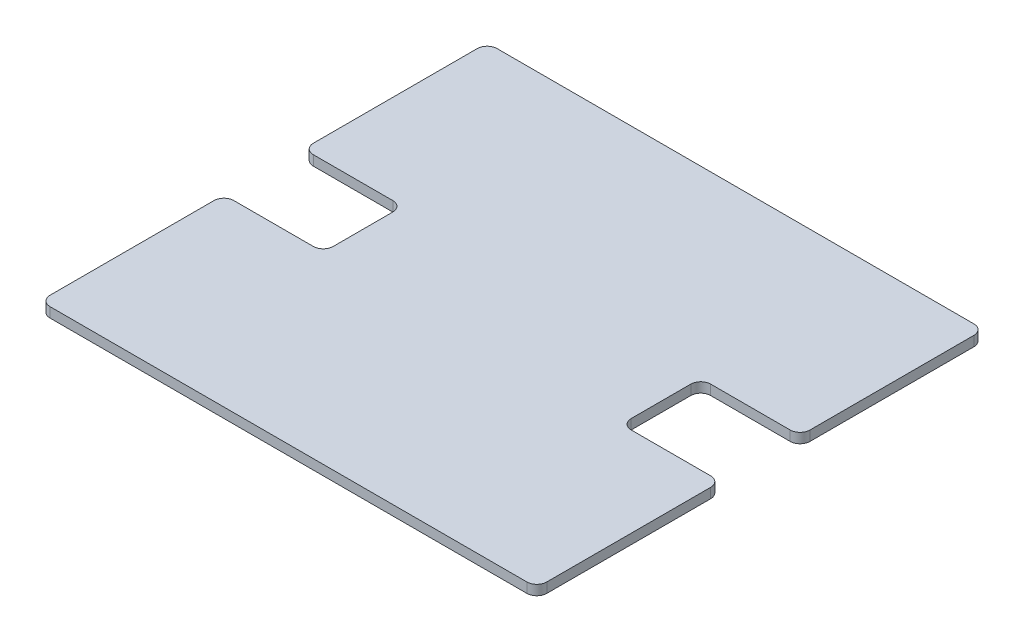
ISO-10303-21;
HEADER;
FILE_DESCRIPTION(('STEP AP214'),'2;1');
FILE_NAME('part.step','',(''),(''),'','','');
FILE_SCHEMA(('AUTOMOTIVE_DESIGN { 1 0 10303 214 1 1 1 1 }'));
ENDSEC;
DATA;
#1=APPLICATION_CONTEXT('core data for automotive mechanical design processes');
#2=APPLICATION_PROTOCOL_DEFINITION('international standard','automotive_design',2000,#1);
#3=PRODUCT_CONTEXT('',#1,'mechanical');
#4=PRODUCT('Part','Part','',(#3));
#5=PRODUCT_RELATED_PRODUCT_CATEGORY('part','',(#4));
#6=PRODUCT_DEFINITION_FORMATION('','',#4);
#7=PRODUCT_DEFINITION_CONTEXT('part definition',#1,'design');
#8=PRODUCT_DEFINITION('design','',#6,#7);
#9=PRODUCT_DEFINITION_SHAPE('','',#8);
#10=(LENGTH_UNIT() NAMED_UNIT(*) SI_UNIT(.MILLI.,.METRE.));
#11=(NAMED_UNIT(*) PLANE_ANGLE_UNIT() SI_UNIT($,.RADIAN.));
#12=(NAMED_UNIT(*) SI_UNIT($,.STERADIAN.) SOLID_ANGLE_UNIT());
#13=UNCERTAINTY_MEASURE_WITH_UNIT(LENGTH_MEASURE(1.E-05),#10,'distance_accuracy_value','');
#14=(GEOMETRIC_REPRESENTATION_CONTEXT(3) GLOBAL_UNCERTAINTY_ASSIGNED_CONTEXT((#13)) GLOBAL_UNIT_ASSIGNED_CONTEXT((#10,
#11,#12)) REPRESENTATION_CONTEXT('',''));
#15=CARTESIAN_POINT('',(0.,0.,0.));
#16=DIRECTION('',(0.,0.,1.));
#17=DIRECTION('',(1.,0.,0.));
#18=AXIS2_PLACEMENT_3D('',#15,#16,#17);
#19=CARTESIAN_POINT('',(-50.,2.,-45.));
#20=DIRECTION('',(1.,0.,0.));
#21=DIRECTION('',(0.,0.,-1.));
#22=AXIS2_PLACEMENT_3D('',#19,#20,#21);
#23=PLANE('',#22);
#24=DIRECTION('',(0.,0.,1.));
#25=VECTOR('',#24,1.);
#26=CARTESIAN_POINT('',(-50.,2.,-45.));
#27=LINE('',#26,#25);
#28=CARTESIAN_POINT('',(-50.,2.,-43.));
#29=VERTEX_POINT('',#28);
#30=CARTESIAN_POINT('',(-50.,2.,-10.));
#31=VERTEX_POINT('',#30);
#32=EDGE_CURVE('E234',#29,#31,#27,.T.);
#33=ORIENTED_EDGE('',*,*,#32,.F.);
#34=DIRECTION('',(0.,-1.,0.));
#35=VECTOR('',#34,1.);
#36=CARTESIAN_POINT('',(-50.,2.,-43.));
#37=LINE('',#36,#35);
#38=CARTESIAN_POINT('',(-50.,0.,-43.));
#39=VERTEX_POINT('',#38);
#40=EDGE_CURVE('E339',#29,#39,#37,.T.);
#41=ORIENTED_EDGE('',*,*,#40,.T.);
#42=DIRECTION('',(0.,0.,1.));
#43=VECTOR('',#42,1.);
#44=CARTESIAN_POINT('',(-50.,0.,-45.));
#45=LINE('',#44,#43);
#46=CARTESIAN_POINT('',(-50.,0.,-10.));
#47=VERTEX_POINT('',#46);
#48=EDGE_CURVE('E396',#39,#47,#45,.T.);
#49=ORIENTED_EDGE('',*,*,#48,.T.);
#50=DIRECTION('',(0.,-1.,0.));
#51=VECTOR('',#50,1.);
#52=CARTESIAN_POINT('',(-50.,2.,-10.));
#53=LINE('',#52,#51);
#54=EDGE_CURVE('E336',#47,#31,#53,.F.);
#55=ORIENTED_EDGE('',*,*,#54,.T.);
#56=EDGE_LOOP('',(#33,#41,#49,#55));
#57=FACE_BOUND('',#56,.T.);
#58=ADVANCED_FACE('F41',(#57),#23,.F.);
#59=CARTESIAN_POINT('',(-50.,2.,-8.00000000000001));
#60=DIRECTION('',(0.,0.,-1.));
#61=DIRECTION('',(-1.,0.,0.));
#62=AXIS2_PLACEMENT_3D('',#59,#60,#61);
#63=PLANE('',#62);
#64=DIRECTION('',(1.,0.,0.));
#65=VECTOR('',#64,1.);
#66=CARTESIAN_POINT('',(-50.,2.,-8.00000000000001));
#67=LINE('',#66,#65);
#68=CARTESIAN_POINT('',(-48.,2.,-8.00000000000001));
#69=VERTEX_POINT('',#68);
#70=CARTESIAN_POINT('',(-32.,2.,-8.00000000000001));
#71=VERTEX_POINT('',#70);
#72=EDGE_CURVE('E240',#69,#71,#67,.T.);
#73=ORIENTED_EDGE('',*,*,#72,.F.);
#74=DIRECTION('',(0.,-1.,0.));
#75=VECTOR('',#74,1.);
#76=CARTESIAN_POINT('',(-48.,2.,-8.00000000000001));
#77=LINE('',#76,#75);
#78=CARTESIAN_POINT('',(-48.,0.,-8.00000000000001));
#79=VERTEX_POINT('',#78);
#80=EDGE_CURVE('E360',#69,#79,#77,.T.);
#81=ORIENTED_EDGE('',*,*,#80,.T.);
#82=DIRECTION('',(1.,0.,0.));
#83=VECTOR('',#82,1.);
#84=CARTESIAN_POINT('',(-50.,0.,-8.00000000000001));
#85=LINE('',#84,#83);
#86=CARTESIAN_POINT('',(-32.,0.,-8.00000000000001));
#87=VERTEX_POINT('',#86);
#88=EDGE_CURVE('E384',#79,#87,#85,.T.);
#89=ORIENTED_EDGE('',*,*,#88,.T.);
#90=DIRECTION('',(0.,-1.,0.));
#91=VECTOR('',#90,1.);
#92=CARTESIAN_POINT('',(-32.,2.,-8.00000000000001));
#93=LINE('',#92,#91);
#94=EDGE_CURVE('E357',#87,#71,#93,.F.);
#95=ORIENTED_EDGE('',*,*,#94,.T.);
#96=EDGE_LOOP('',(#73,#81,#89,#95));
#97=FACE_BOUND('',#96,.T.);
#98=ADVANCED_FACE('F392',(#97),#63,.F.);
#99=CARTESIAN_POINT('',(-30.,2.,-8.00000000000001));
#100=DIRECTION('',(1.,0.,0.));
#101=DIRECTION('',(0.,0.,-1.));
#102=AXIS2_PLACEMENT_3D('',#99,#100,#101);
#103=PLANE('',#102);
#104=DIRECTION('',(0.,0.,1.));
#105=VECTOR('',#104,1.);
#106=CARTESIAN_POINT('',(-30.,0.,-8.00000000000001));
#107=LINE('',#106,#105);
#108=CARTESIAN_POINT('',(-30.,0.,-6.00000000000001));
#109=VERTEX_POINT('',#108);
#110=CARTESIAN_POINT('',(-30.,0.,6.00000000000001));
#111=VERTEX_POINT('',#110);
#112=EDGE_CURVE('E386',#109,#111,#107,.T.);
#113=ORIENTED_EDGE('',*,*,#112,.T.);
#114=DIRECTION('',(0.,-1.,0.));
#115=VECTOR('',#114,1.);
#116=CARTESIAN_POINT('',(-30.,2.,6.00000000000001));
#117=LINE('',#116,#115);
#118=CARTESIAN_POINT('',(-30.,2.,6.00000000000001));
#119=VERTEX_POINT('',#118);
#120=EDGE_CURVE('E354',#111,#119,#117,.F.);
#121=ORIENTED_EDGE('',*,*,#120,.T.);
#122=DIRECTION('',(0.,0.,1.));
#123=VECTOR('',#122,1.);
#124=CARTESIAN_POINT('',(-30.,2.,-8.00000000000001));
#125=LINE('',#124,#123);
#126=CARTESIAN_POINT('',(-30.,2.,-6.00000000000001));
#127=VERTEX_POINT('',#126);
#128=EDGE_CURVE('E403',#127,#119,#125,.T.);
#129=ORIENTED_EDGE('',*,*,#128,.F.);
#130=DIRECTION('',(0.,-1.,0.));
#131=VECTOR('',#130,1.);
#132=CARTESIAN_POINT('',(-30.,0.,-6.00000000000001));
#133=LINE('',#132,#131);
#134=EDGE_CURVE('E350',#127,#109,#133,.T.);
#135=ORIENTED_EDGE('',*,*,#134,.T.);
#136=EDGE_LOOP('',(#113,#121,#129,#135));
#137=FACE_BOUND('',#136,.T.);
#138=ADVANCED_FACE('F406',(#137),#103,.F.);
#139=CARTESIAN_POINT('',(-50.,2.,8.00000000000001));
#140=DIRECTION('',(0.,0.,1.));
#141=DIRECTION('',(1.,0.,0.));
#142=AXIS2_PLACEMENT_3D('',#139,#140,#141);
#143=PLANE('',#142);
#144=DIRECTION('',(-1.,0.,0.));
#145=VECTOR('',#144,1.);
#146=CARTESIAN_POINT('',(-50.,0.,8.00000000000001));
#147=LINE('',#146,#145);
#148=CARTESIAN_POINT('',(-32.,0.,8.00000000000001));
#149=VERTEX_POINT('',#148);
#150=CARTESIAN_POINT('',(-48.,0.,8.00000000000001));
#151=VERTEX_POINT('',#150);
#152=EDGE_CURVE('E449',#149,#151,#147,.T.);
#153=ORIENTED_EDGE('',*,*,#152,.T.);
#154=DIRECTION('',(0.,-1.,0.));
#155=VECTOR('',#154,1.);
#156=CARTESIAN_POINT('',(-48.,2.,8.00000000000001));
#157=LINE('',#156,#155);
#158=CARTESIAN_POINT('',(-48.,2.,8.00000000000001));
#159=VERTEX_POINT('',#158);
#160=EDGE_CURVE('E347',#151,#159,#157,.F.);
#161=ORIENTED_EDGE('',*,*,#160,.T.);
#162=DIRECTION('',(-1.,0.,0.));
#163=VECTOR('',#162,1.);
#164=CARTESIAN_POINT('',(-50.,2.,8.00000000000001));
#165=LINE('',#164,#163);
#166=CARTESIAN_POINT('',(-32.,2.,8.00000000000001));
#167=VERTEX_POINT('',#166);
#168=EDGE_CURVE('E409',#167,#159,#165,.T.);
#169=ORIENTED_EDGE('',*,*,#168,.F.);
#170=DIRECTION('',(0.,-1.,0.));
#171=VECTOR('',#170,1.);
#172=CARTESIAN_POINT('',(-32.,0.,8.00000000000001));
#173=LINE('',#172,#171);
#174=EDGE_CURVE('E343',#167,#149,#173,.T.);
#175=ORIENTED_EDGE('',*,*,#174,.T.);
#176=EDGE_LOOP('',(#153,#161,#169,#175));
#177=FACE_BOUND('',#176,.T.);
#178=ADVANCED_FACE('F694',(#177),#143,.F.);
#179=CARTESIAN_POINT('',(-50.,2.,45.));
#180=DIRECTION('',(1.,0.,0.));
#181=DIRECTION('',(0.,0.,-1.));
#182=AXIS2_PLACEMENT_3D('',#179,#180,#181);
#183=PLANE('',#182);
#184=DIRECTION('',(0.,0.,1.));
#185=VECTOR('',#184,1.);
#186=CARTESIAN_POINT('',(-50.,0.,45.));
#187=LINE('',#186,#185);
#188=CARTESIAN_POINT('',(-50.,0.,10.));
#189=VERTEX_POINT('',#188);
#190=CARTESIAN_POINT('',(-50.,0.,43.));
#191=VERTEX_POINT('',#190);
#192=EDGE_CURVE('E453',#189,#191,#187,.T.);
#193=ORIENTED_EDGE('',*,*,#192,.T.);
#194=DIRECTION('',(0.,-1.,0.));
#195=VECTOR('',#194,1.);
#196=CARTESIAN_POINT('',(-50.,2.,43.));
#197=LINE('',#196,#195);
#198=CARTESIAN_POINT('',(-50.,2.,43.));
#199=VERTEX_POINT('',#198);
#200=EDGE_CURVE('E333',#191,#199,#197,.F.);
#201=ORIENTED_EDGE('',*,*,#200,.T.);
#202=DIRECTION('',(0.,0.,1.));
#203=VECTOR('',#202,1.);
#204=CARTESIAN_POINT('',(-50.,2.,45.));
#205=LINE('',#204,#203);
#206=CARTESIAN_POINT('',(-50.,2.,10.));
#207=VERTEX_POINT('',#206);
#208=EDGE_CURVE('E414',#207,#199,#205,.T.);
#209=ORIENTED_EDGE('',*,*,#208,.F.);
#210=DIRECTION('',(0.,-1.,0.));
#211=VECTOR('',#210,1.);
#212=CARTESIAN_POINT('',(-50.,2.,10.));
#213=LINE('',#212,#211);
#214=EDGE_CURVE('E329',#207,#189,#213,.T.);
#215=ORIENTED_EDGE('',*,*,#214,.T.);
#216=EDGE_LOOP('',(#193,#201,#209,#215));
#217=FACE_BOUND('',#216,.T.);
#218=ADVANCED_FACE('F684',(#217),#183,.F.);
#219=CARTESIAN_POINT('',(-50.,2.,45.));
#220=DIRECTION('',(0.,0.,-1.));
#221=DIRECTION('',(-1.,0.,0.));
#222=AXIS2_PLACEMENT_3D('',#219,#220,#221);
#223=PLANE('',#222);
#224=DIRECTION('',(1.,0.,0.));
#225=VECTOR('',#224,1.);
#226=CARTESIAN_POINT('',(-50.,0.,45.));
#227=LINE('',#226,#225);
#228=CARTESIAN_POINT('',(-48.,0.,45.));
#229=VERTEX_POINT('',#228);
#230=CARTESIAN_POINT('',(48.,0.,45.));
#231=VERTEX_POINT('',#230);
#232=EDGE_CURVE('E457',#229,#231,#227,.T.);
#233=ORIENTED_EDGE('',*,*,#232,.T.);
#234=DIRECTION('',(0.,-1.,0.));
#235=VECTOR('',#234,1.);
#236=CARTESIAN_POINT('',(48.,2.,45.));
#237=LINE('',#236,#235);
#238=CARTESIAN_POINT('',(48.,2.,45.));
#239=VERTEX_POINT('',#238);
#240=EDGE_CURVE('E326',#231,#239,#237,.F.);
#241=ORIENTED_EDGE('',*,*,#240,.T.);
#242=DIRECTION('',(1.,0.,0.));
#243=VECTOR('',#242,1.);
#244=CARTESIAN_POINT('',(-50.,2.,45.));
#245=LINE('',#244,#243);
#246=CARTESIAN_POINT('',(-48.,2.,45.));
#247=VERTEX_POINT('',#246);
#248=EDGE_CURVE('E421',#247,#239,#245,.T.);
#249=ORIENTED_EDGE('',*,*,#248,.F.);
#250=DIRECTION('',(0.,-1.,0.));
#251=VECTOR('',#250,1.);
#252=CARTESIAN_POINT('',(-48.,2.,45.));
#253=LINE('',#252,#251);
#254=EDGE_CURVE('E322',#247,#229,#253,.T.);
#255=ORIENTED_EDGE('',*,*,#254,.T.);
#256=EDGE_LOOP('',(#233,#241,#249,#255));
#257=FACE_BOUND('',#256,.T.);
#258=ADVANCED_FACE('F674',(#257),#223,.F.);
#259=CARTESIAN_POINT('',(50.,2.,45.));
#260=DIRECTION('',(-1.,0.,0.));
#261=DIRECTION('',(0.,0.,1.));
#262=AXIS2_PLACEMENT_3D('',#259,#260,#261);
#263=PLANE('',#262);
#264=DIRECTION('',(0.,0.,-1.));
#265=VECTOR('',#264,1.);
#266=CARTESIAN_POINT('',(50.,0.,45.));
#267=LINE('',#266,#265);
#268=CARTESIAN_POINT('',(50.,0.,43.));
#269=VERTEX_POINT('',#268);
#270=CARTESIAN_POINT('',(50.,0.,10.));
#271=VERTEX_POINT('',#270);
#272=EDGE_CURVE('E461',#269,#271,#267,.T.);
#273=ORIENTED_EDGE('',*,*,#272,.T.);
#274=DIRECTION('',(0.,-1.,0.));
#275=VECTOR('',#274,1.);
#276=CARTESIAN_POINT('',(50.,2.,10.));
#277=LINE('',#276,#275);
#278=CARTESIAN_POINT('',(50.,2.,10.));
#279=VERTEX_POINT('',#278);
#280=EDGE_CURVE('E319',#271,#279,#277,.F.);
#281=ORIENTED_EDGE('',*,*,#280,.T.);
#282=DIRECTION('',(0.,0.,-1.));
#283=VECTOR('',#282,1.);
#284=CARTESIAN_POINT('',(50.,2.,45.));
#285=LINE('',#284,#283);
#286=CARTESIAN_POINT('',(50.,2.,43.));
#287=VERTEX_POINT('',#286);
#288=EDGE_CURVE('E425',#287,#279,#285,.T.);
#289=ORIENTED_EDGE('',*,*,#288,.F.);
#290=DIRECTION('',(0.,-1.,0.));
#291=VECTOR('',#290,1.);
#292=CARTESIAN_POINT('',(50.,2.,43.));
#293=LINE('',#292,#291);
#294=EDGE_CURVE('E315',#287,#269,#293,.T.);
#295=ORIENTED_EDGE('',*,*,#294,.T.);
#296=EDGE_LOOP('',(#273,#281,#289,#295));
#297=FACE_BOUND('',#296,.T.);
#298=ADVANCED_FACE('F664',(#297),#263,.F.);
#299=CARTESIAN_POINT('',(50.,2.,8.00000000000001));
#300=DIRECTION('',(0.,0.,1.));
#301=DIRECTION('',(1.,0.,0.));
#302=AXIS2_PLACEMENT_3D('',#299,#300,#301);
#303=PLANE('',#302);
#304=DIRECTION('',(-1.,0.,0.));
#305=VECTOR('',#304,1.);
#306=CARTESIAN_POINT('',(50.,0.,8.00000000000001));
#307=LINE('',#306,#305);
#308=CARTESIAN_POINT('',(48.,0.,8.00000000000001));
#309=VERTEX_POINT('',#308);
#310=CARTESIAN_POINT('',(32.,0.,8.00000000000001));
#311=VERTEX_POINT('',#310);
#312=EDGE_CURVE('E465',#309,#311,#307,.T.);
#313=ORIENTED_EDGE('',*,*,#312,.T.);
#314=DIRECTION('',(0.,-1.,0.));
#315=VECTOR('',#314,1.);
#316=CARTESIAN_POINT('',(32.,2.,8.00000000000001));
#317=LINE('',#316,#315);
#318=CARTESIAN_POINT('',(32.,2.,8.00000000000001));
#319=VERTEX_POINT('',#318);
#320=EDGE_CURVE('E312',#311,#319,#317,.F.);
#321=ORIENTED_EDGE('',*,*,#320,.T.);
#322=DIRECTION('',(-1.,0.,0.));
#323=VECTOR('',#322,1.);
#324=CARTESIAN_POINT('',(50.,2.,8.00000000000001));
#325=LINE('',#324,#323);
#326=CARTESIAN_POINT('',(48.,2.,8.00000000000001));
#327=VERTEX_POINT('',#326);
#328=EDGE_CURVE('E429',#327,#319,#325,.T.);
#329=ORIENTED_EDGE('',*,*,#328,.F.);
#330=DIRECTION('',(0.,-1.,0.));
#331=VECTOR('',#330,1.);
#332=CARTESIAN_POINT('',(48.,2.,8.00000000000001));
#333=LINE('',#332,#331);
#334=EDGE_CURVE('E308',#327,#309,#333,.T.);
#335=ORIENTED_EDGE('',*,*,#334,.T.);
#336=EDGE_LOOP('',(#313,#321,#329,#335));
#337=FACE_BOUND('',#336,.T.);
#338=ADVANCED_FACE('F654',(#337),#303,.F.);
#339=CARTESIAN_POINT('',(30.,2.,-8.00000000000001));
#340=DIRECTION('',(-1.,0.,0.));
#341=DIRECTION('',(0.,0.,1.));
#342=AXIS2_PLACEMENT_3D('',#339,#340,#341);
#343=PLANE('',#342);
#344=DIRECTION('',(0.,0.,-1.));
#345=VECTOR('',#344,1.);
#346=CARTESIAN_POINT('',(30.,0.,-8.00000000000001));
#347=LINE('',#346,#345);
#348=CARTESIAN_POINT('',(30.,0.,6.00000000000001));
#349=VERTEX_POINT('',#348);
#350=CARTESIAN_POINT('',(30.,0.,-6.00000000000001));
#351=VERTEX_POINT('',#350);
#352=EDGE_CURVE('E469',#349,#351,#347,.T.);
#353=ORIENTED_EDGE('',*,*,#352,.T.);
#354=DIRECTION('',(0.,-1.,0.));
#355=VECTOR('',#354,1.);
#356=CARTESIAN_POINT('',(30.,2.,-6.00000000000001));
#357=LINE('',#356,#355);
#358=CARTESIAN_POINT('',(30.,2.,-6.00000000000001));
#359=VERTEX_POINT('',#358);
#360=EDGE_CURVE('E305',#351,#359,#357,.F.);
#361=ORIENTED_EDGE('',*,*,#360,.T.);
#362=DIRECTION('',(0.,0.,-1.));
#363=VECTOR('',#362,1.);
#364=CARTESIAN_POINT('',(30.,2.,-8.00000000000001));
#365=LINE('',#364,#363);
#366=CARTESIAN_POINT('',(30.,2.,6.00000000000001));
#367=VERTEX_POINT('',#366);
#368=EDGE_CURVE('E433',#367,#359,#365,.T.);
#369=ORIENTED_EDGE('',*,*,#368,.F.);
#370=DIRECTION('',(0.,-1.,0.));
#371=VECTOR('',#370,1.);
#372=CARTESIAN_POINT('',(30.,0.,6.00000000000001));
#373=LINE('',#372,#371);
#374=EDGE_CURVE('E301',#367,#349,#373,.T.);
#375=ORIENTED_EDGE('',*,*,#374,.T.);
#376=EDGE_LOOP('',(#353,#361,#369,#375));
#377=FACE_BOUND('',#376,.T.);
#378=ADVANCED_FACE('F490',(#377),#343,.F.);
#379=CARTESIAN_POINT('',(50.,2.,-8.00000000000001));
#380=DIRECTION('',(0.,0.,-1.));
#381=DIRECTION('',(-1.,0.,0.));
#382=AXIS2_PLACEMENT_3D('',#379,#380,#381);
#383=PLANE('',#382);
#384=DIRECTION('',(1.,0.,0.));
#385=VECTOR('',#384,1.);
#386=CARTESIAN_POINT('',(50.,0.,-8.00000000000001));
#387=LINE('',#386,#385);
#388=CARTESIAN_POINT('',(32.,0.,-8.00000000000001));
#389=VERTEX_POINT('',#388);
#390=CARTESIAN_POINT('',(48.,0.,-8.00000000000001));
#391=VERTEX_POINT('',#390);
#392=EDGE_CURVE('E242',#389,#391,#387,.T.);
#393=ORIENTED_EDGE('',*,*,#392,.T.);
#394=DIRECTION('',(0.,-1.,0.));
#395=VECTOR('',#394,1.);
#396=CARTESIAN_POINT('',(48.,2.,-8.00000000000001));
#397=LINE('',#396,#395);
#398=CARTESIAN_POINT('',(48.,2.,-8.00000000000001));
#399=VERTEX_POINT('',#398);
#400=EDGE_CURVE('E57',#391,#399,#397,.F.);
#401=ORIENTED_EDGE('',*,*,#400,.T.);
#402=DIRECTION('',(1.,0.,0.));
#403=VECTOR('',#402,1.);
#404=CARTESIAN_POINT('',(50.,2.,-8.00000000000001));
#405=LINE('',#404,#403);
#406=CARTESIAN_POINT('',(32.,2.,-8.00000000000001));
#407=VERTEX_POINT('',#406);
#408=EDGE_CURVE('E436',#407,#399,#405,.T.);
#409=ORIENTED_EDGE('',*,*,#408,.F.);
#410=DIRECTION('',(0.,-1.,0.));
#411=VECTOR('',#410,1.);
#412=CARTESIAN_POINT('',(32.,0.,-8.00000000000001));
#413=LINE('',#412,#411);
#414=EDGE_CURVE('E295',#407,#389,#413,.T.);
#415=ORIENTED_EDGE('',*,*,#414,.T.);
#416=EDGE_LOOP('',(#393,#401,#409,#415));
#417=FACE_BOUND('',#416,.T.);
#418=ADVANCED_FACE('F474',(#417),#383,.F.);
#419=CARTESIAN_POINT('',(50.,2.,-45.));
#420=DIRECTION('',(-1.,0.,0.));
#421=DIRECTION('',(0.,0.,1.));
#422=AXIS2_PLACEMENT_3D('',#419,#420,#421);
#423=PLANE('',#422);
#424=DIRECTION('',(0.,0.,-1.));
#425=VECTOR('',#424,1.);
#426=CARTESIAN_POINT('',(50.,0.,-45.));
#427=LINE('',#426,#425);
#428=CARTESIAN_POINT('',(50.,0.,-10.));
#429=VERTEX_POINT('',#428);
#430=CARTESIAN_POINT('',(50.,0.,-43.));
#431=VERTEX_POINT('',#430);
#432=EDGE_CURVE('E235',#429,#431,#427,.T.);
#433=ORIENTED_EDGE('',*,*,#432,.T.);
#434=DIRECTION('',(0.,-1.,0.));
#435=VECTOR('',#434,1.);
#436=CARTESIAN_POINT('',(50.,2.,-43.));
#437=LINE('',#436,#435);
#438=CARTESIAN_POINT('',(50.,2.,-43.));
#439=VERTEX_POINT('',#438);
#440=EDGE_CURVE('E209',#431,#439,#437,.F.);
#441=ORIENTED_EDGE('',*,*,#440,.T.);
#442=DIRECTION('',(0.,0.,-1.));
#443=VECTOR('',#442,1.);
#444=CARTESIAN_POINT('',(50.,2.,-45.));
#445=LINE('',#444,#443);
#446=CARTESIAN_POINT('',(50.,2.,-10.));
#447=VERTEX_POINT('',#446);
#448=EDGE_CURVE('E439',#447,#439,#445,.T.);
#449=ORIENTED_EDGE('',*,*,#448,.F.);
#450=DIRECTION('',(0.,-1.,0.));
#451=VECTOR('',#450,1.);
#452=CARTESIAN_POINT('',(50.,2.,-10.));
#453=LINE('',#452,#451);
#454=EDGE_CURVE('E215',#447,#429,#453,.T.);
#455=ORIENTED_EDGE('',*,*,#454,.T.);
#456=EDGE_LOOP('',(#433,#441,#449,#455));
#457=FACE_BOUND('',#456,.T.);
#458=ADVANCED_FACE('F482',(#457),#423,.F.);
#459=CARTESIAN_POINT('',(-50.,2.,-45.));
#460=DIRECTION('',(0.,0.,1.));
#461=DIRECTION('',(1.,0.,0.));
#462=AXIS2_PLACEMENT_3D('',#459,#460,#461);
#463=PLANE('',#462);
#464=DIRECTION('',(-1.,0.,0.));
#465=VECTOR('',#464,1.);
#466=CARTESIAN_POINT('',(-50.,2.,-45.));
#467=LINE('',#466,#465);
#468=CARTESIAN_POINT('',(48.,2.,-45.));
#469=VERTEX_POINT('',#468);
#470=CARTESIAN_POINT('',(-48.,2.,-45.));
#471=VERTEX_POINT('',#470);
#472=EDGE_CURVE('E225',#469,#471,#467,.T.);
#473=ORIENTED_EDGE('',*,*,#472,.F.);
#474=DIRECTION('',(0.,-1.,0.));
#475=VECTOR('',#474,1.);
#476=CARTESIAN_POINT('',(48.,2.,-45.));
#477=LINE('',#476,#475);
#478=CARTESIAN_POINT('',(48.,0.,-45.));
#479=VERTEX_POINT('',#478);
#480=EDGE_CURVE('E208',#469,#479,#477,.T.);
#481=ORIENTED_EDGE('',*,*,#480,.T.);
#482=DIRECTION('',(-1.,0.,0.));
#483=VECTOR('',#482,1.);
#484=CARTESIAN_POINT('',(-50.,0.,-45.));
#485=LINE('',#484,#483);
#486=CARTESIAN_POINT('',(-48.,0.,-45.));
#487=VERTEX_POINT('',#486);
#488=EDGE_CURVE('E222',#479,#487,#485,.T.);
#489=ORIENTED_EDGE('',*,*,#488,.T.);
#490=DIRECTION('',(0.,-1.,0.));
#491=VECTOR('',#490,1.);
#492=CARTESIAN_POINT('',(-48.,2.,-45.));
#493=LINE('',#492,#491);
#494=EDGE_CURVE('E228',#487,#471,#493,.F.);
#495=ORIENTED_EDGE('',*,*,#494,.T.);
#496=EDGE_LOOP('',(#473,#481,#489,#495));
#497=FACE_BOUND('',#496,.T.);
#498=ADVANCED_FACE('F221',(#497),#463,.F.);
#499=CARTESIAN_POINT('',(0.,2.,0.));
#500=DIRECTION('',(0.,1.,0.));
#501=DIRECTION('',(0.,0.,1.));
#502=AXIS2_PLACEMENT_3D('',#499,#500,#501);
#503=PLANE('',#502);
#504=ORIENTED_EDGE('',*,*,#448,.T.);
#505=CARTESIAN_POINT('',(48.,2.,-43.));
#506=DIRECTION('',(0.,1.,0.));
#507=DIRECTION('',(0.,0.,1.));
#508=AXIS2_PLACEMENT_3D('',#505,#506,#507);
#509=CIRCLE('',#508,2.);
#510=EDGE_CURVE('E292',#439,#469,#509,.T.);
#511=ORIENTED_EDGE('',*,*,#510,.T.);
#512=ORIENTED_EDGE('',*,*,#472,.T.);
#513=CARTESIAN_POINT('',(-48.,2.,-43.));
#514=DIRECTION('',(0.,1.,0.));
#515=DIRECTION('',(0.,0.,1.));
#516=AXIS2_PLACEMENT_3D('',#513,#514,#515);
#517=CIRCLE('',#516,2.);
#518=EDGE_CURVE('E277',#471,#29,#517,.T.);
#519=ORIENTED_EDGE('',*,*,#518,.T.);
#520=ORIENTED_EDGE('',*,*,#32,.T.);
#521=CARTESIAN_POINT('',(-48.,2.,-10.));
#522=DIRECTION('',(0.,1.,0.));
#523=DIRECTION('',(0.,0.,1.));
#524=AXIS2_PLACEMENT_3D('',#521,#522,#523);
#525=CIRCLE('',#524,2.);
#526=EDGE_CURVE('E271',#31,#69,#525,.T.);
#527=ORIENTED_EDGE('',*,*,#526,.T.);
#528=ORIENTED_EDGE('',*,*,#72,.T.);
#529=CARTESIAN_POINT('',(-32.,2.,-6.00000000000001));
#530=DIRECTION('',(0.,1.,0.));
#531=DIRECTION('',(0.,0.,1.));
#532=AXIS2_PLACEMENT_3D('',#529,#530,#531);
#533=CIRCLE('',#532,2.);
#534=EDGE_CURVE('E11',#71,#127,#533,.F.);
#535=ORIENTED_EDGE('',*,*,#534,.T.);
#536=ORIENTED_EDGE('',*,*,#128,.T.);
#537=CARTESIAN_POINT('',(-32.,2.,6.00000000000001));
#538=DIRECTION('',(0.,1.,0.));
#539=DIRECTION('',(0.,0.,1.));
#540=AXIS2_PLACEMENT_3D('',#537,#538,#539);
#541=CIRCLE('',#540,2.);
#542=EDGE_CURVE('E378',#119,#167,#541,.F.);
#543=ORIENTED_EDGE('',*,*,#542,.T.);
#544=ORIENTED_EDGE('',*,*,#168,.T.);
#545=CARTESIAN_POINT('',(-48.,2.,10.));
#546=DIRECTION('',(0.,1.,0.));
#547=DIRECTION('',(0.,0.,1.));
#548=AXIS2_PLACEMENT_3D('',#545,#546,#547);
#549=CIRCLE('',#548,2.);
#550=EDGE_CURVE('E274',#159,#207,#549,.T.);
#551=ORIENTED_EDGE('',*,*,#550,.T.);
#552=ORIENTED_EDGE('',*,*,#208,.T.);
#553=CARTESIAN_POINT('',(-48.,2.,43.));
#554=DIRECTION('',(0.,1.,0.));
#555=DIRECTION('',(0.,0.,1.));
#556=AXIS2_PLACEMENT_3D('',#553,#554,#555);
#557=CIRCLE('',#556,2.);
#558=EDGE_CURVE('E280',#199,#247,#557,.T.);
#559=ORIENTED_EDGE('',*,*,#558,.T.);
#560=ORIENTED_EDGE('',*,*,#248,.T.);
#561=CARTESIAN_POINT('',(48.,2.,43.));
#562=DIRECTION('',(0.,1.,0.));
#563=DIRECTION('',(0.,0.,1.));
#564=AXIS2_PLACEMENT_3D('',#561,#562,#563);
#565=CIRCLE('',#564,2.);
#566=EDGE_CURVE('E283',#239,#287,#565,.T.);
#567=ORIENTED_EDGE('',*,*,#566,.T.);
#568=ORIENTED_EDGE('',*,*,#288,.T.);
#569=CARTESIAN_POINT('',(48.,2.,10.));
#570=DIRECTION('',(0.,1.,0.));
#571=DIRECTION('',(0.,0.,1.));
#572=AXIS2_PLACEMENT_3D('',#569,#570,#571);
#573=CIRCLE('',#572,2.);
#574=EDGE_CURVE('E286',#279,#327,#573,.T.);
#575=ORIENTED_EDGE('',*,*,#574,.T.);
#576=ORIENTED_EDGE('',*,*,#328,.T.);
#577=CARTESIAN_POINT('',(32.,2.,6.00000000000001));
#578=DIRECTION('',(0.,1.,0.));
#579=DIRECTION('',(0.,0.,1.));
#580=AXIS2_PLACEMENT_3D('',#577,#578,#579);
#581=CIRCLE('',#580,2.);
#582=EDGE_CURVE('E372',#319,#367,#581,.F.);
#583=ORIENTED_EDGE('',*,*,#582,.T.);
#584=ORIENTED_EDGE('',*,*,#368,.T.);
#585=CARTESIAN_POINT('',(32.,2.,-6.00000000000001));
#586=DIRECTION('',(0.,1.,0.));
#587=DIRECTION('',(0.,0.,1.));
#588=AXIS2_PLACEMENT_3D('',#585,#586,#587);
#589=CIRCLE('',#588,2.);
#590=EDGE_CURVE('E64',#359,#407,#589,.F.);
#591=ORIENTED_EDGE('',*,*,#590,.T.);
#592=ORIENTED_EDGE('',*,*,#408,.T.);
#593=CARTESIAN_POINT('',(48.,2.,-10.));
#594=DIRECTION('',(0.,1.,0.));
#595=DIRECTION('',(0.,0.,1.));
#596=AXIS2_PLACEMENT_3D('',#593,#594,#595);
#597=CIRCLE('',#596,2.);
#598=EDGE_CURVE('E289',#399,#447,#597,.T.);
#599=ORIENTED_EDGE('',*,*,#598,.T.);
#600=EDGE_LOOP('',(#504,#511,#512,#519,#520,#527,#528,#535,#536,#543,#544,#551,#552,#559,#560,
#567,#568,#575,#576,#583,#584,#591,#592,#599));
#601=FACE_BOUND('',#600,.T.);
#602=ADVANCED_FACE('F402',(#601),#503,.T.);
#603=CARTESIAN_POINT('',(0.,0.,0.));
#604=DIRECTION('',(0.,1.,0.));
#605=DIRECTION('',(0.,0.,1.));
#606=AXIS2_PLACEMENT_3D('',#603,#604,#605);
#607=PLANE('',#606);
#608=ORIENTED_EDGE('',*,*,#488,.F.);
#609=CARTESIAN_POINT('',(48.,0.,-43.));
#610=DIRECTION('',(0.,1.,0.));
#611=DIRECTION('',(0.,0.,1.));
#612=AXIS2_PLACEMENT_3D('',#609,#610,#611);
#613=CIRCLE('',#612,2.);
#614=EDGE_CURVE('E204',#479,#431,#613,.F.);
#615=ORIENTED_EDGE('',*,*,#614,.T.);
#616=ORIENTED_EDGE('',*,*,#432,.F.);
#617=CARTESIAN_POINT('',(48.,0.,-10.));
#618=DIRECTION('',(0.,1.,0.));
#619=DIRECTION('',(0.,0.,1.));
#620=AXIS2_PLACEMENT_3D('',#617,#618,#619);
#621=CIRCLE('',#620,2.);
#622=EDGE_CURVE('E216',#429,#391,#621,.F.);
#623=ORIENTED_EDGE('',*,*,#622,.T.);
#624=ORIENTED_EDGE('',*,*,#392,.F.);
#625=CARTESIAN_POINT('',(32.,0.,-6.00000000000001));
#626=DIRECTION('',(0.,1.,0.));
#627=DIRECTION('',(0.,0.,1.));
#628=AXIS2_PLACEMENT_3D('',#625,#626,#627);
#629=CIRCLE('',#628,2.);
#630=EDGE_CURVE('E364',#389,#351,#629,.T.);
#631=ORIENTED_EDGE('',*,*,#630,.T.);
#632=ORIENTED_EDGE('',*,*,#352,.F.);
#633=CARTESIAN_POINT('',(32.,0.,6.00000000000001));
#634=DIRECTION('',(0.,1.,0.));
#635=DIRECTION('',(0.,0.,1.));
#636=AXIS2_PLACEMENT_3D('',#633,#634,#635);
#637=CIRCLE('',#636,2.);
#638=EDGE_CURVE('E369',#349,#311,#637,.T.);
#639=ORIENTED_EDGE('',*,*,#638,.T.);
#640=ORIENTED_EDGE('',*,*,#312,.F.);
#641=CARTESIAN_POINT('',(48.,0.,10.));
#642=DIRECTION('',(0.,1.,0.));
#643=DIRECTION('',(0.,0.,1.));
#644=AXIS2_PLACEMENT_3D('',#641,#642,#643);
#645=CIRCLE('',#644,2.);
#646=EDGE_CURVE('E261',#309,#271,#645,.F.);
#647=ORIENTED_EDGE('',*,*,#646,.T.);
#648=ORIENTED_EDGE('',*,*,#272,.F.);
#649=CARTESIAN_POINT('',(48.,0.,43.));
#650=DIRECTION('',(0.,1.,0.));
#651=DIRECTION('',(0.,0.,1.));
#652=AXIS2_PLACEMENT_3D('',#649,#650,#651);
#653=CIRCLE('',#652,2.);
#654=EDGE_CURVE('E258',#269,#231,#653,.F.);
#655=ORIENTED_EDGE('',*,*,#654,.T.);
#656=ORIENTED_EDGE('',*,*,#232,.F.);
#657=CARTESIAN_POINT('',(-48.,0.,43.));
#658=DIRECTION('',(0.,1.,0.));
#659=DIRECTION('',(0.,0.,1.));
#660=AXIS2_PLACEMENT_3D('',#657,#658,#659);
#661=CIRCLE('',#660,2.);
#662=EDGE_CURVE('E255',#229,#191,#661,.F.);
#663=ORIENTED_EDGE('',*,*,#662,.T.);
#664=ORIENTED_EDGE('',*,*,#192,.F.);
#665=CARTESIAN_POINT('',(-48.,0.,10.));
#666=DIRECTION('',(0.,1.,0.));
#667=DIRECTION('',(0.,0.,1.));
#668=AXIS2_PLACEMENT_3D('',#665,#666,#667);
#669=CIRCLE('',#668,2.);
#670=EDGE_CURVE('E250',#189,#151,#669,.F.);
#671=ORIENTED_EDGE('',*,*,#670,.T.);
#672=ORIENTED_EDGE('',*,*,#152,.F.);
#673=CARTESIAN_POINT('',(-32.,0.,6.00000000000001));
#674=DIRECTION('',(0.,1.,0.));
#675=DIRECTION('',(0.,0.,1.));
#676=AXIS2_PLACEMENT_3D('',#673,#674,#675);
#677=CIRCLE('',#676,2.);
#678=EDGE_CURVE('E375',#149,#111,#677,.T.);
#679=ORIENTED_EDGE('',*,*,#678,.T.);
#680=ORIENTED_EDGE('',*,*,#112,.F.);
#681=CARTESIAN_POINT('',(-32.,0.,-6.00000000000001));
#682=DIRECTION('',(0.,1.,0.));
#683=DIRECTION('',(0.,0.,1.));
#684=AXIS2_PLACEMENT_3D('',#681,#682,#683);
#685=CIRCLE('',#684,2.);
#686=EDGE_CURVE('E50',#109,#87,#685,.T.);
#687=ORIENTED_EDGE('',*,*,#686,.T.);
#688=ORIENTED_EDGE('',*,*,#88,.F.);
#689=CARTESIAN_POINT('',(-48.,0.,-10.));
#690=DIRECTION('',(0.,1.,0.));
#691=DIRECTION('',(0.,0.,1.));
#692=AXIS2_PLACEMENT_3D('',#689,#690,#691);
#693=CIRCLE('',#692,2.);
#694=EDGE_CURVE('E227',#79,#47,#693,.F.);
#695=ORIENTED_EDGE('',*,*,#694,.T.);
#696=ORIENTED_EDGE('',*,*,#48,.F.);
#697=CARTESIAN_POINT('',(-48.,0.,-43.));
#698=DIRECTION('',(0.,1.,0.));
#699=DIRECTION('',(0.,0.,1.));
#700=AXIS2_PLACEMENT_3D('',#697,#698,#699);
#701=CIRCLE('',#700,2.);
#702=EDGE_CURVE('E232',#39,#487,#701,.F.);
#703=ORIENTED_EDGE('',*,*,#702,.T.);
#704=EDGE_LOOP('',(#608,#615,#616,#623,#624,#631,#632,#639,#640,#647,#648,#655,#656,#663,#664,
#671,#672,#679,#680,#687,#688,#695,#696,#703));
#705=FACE_BOUND('',#704,.T.);
#706=ADVANCED_FACE('F230',(#705),#607,.F.);
#707=CARTESIAN_POINT('',(48.,2.,-43.));
#708=DIRECTION('',(0.,-1.,0.));
#709=DIRECTION('',(0.,0.,-1.));
#710=AXIS2_PLACEMENT_3D('',#707,#708,#709);
#711=CYLINDRICAL_SURFACE('',#710,2.);
#712=ORIENTED_EDGE('',*,*,#510,.F.);
#713=ORIENTED_EDGE('',*,*,#440,.F.);
#714=ORIENTED_EDGE('',*,*,#614,.F.);
#715=ORIENTED_EDGE('',*,*,#480,.F.);
#716=EDGE_LOOP('',(#712,#713,#714,#715));
#717=FACE_BOUND('',#716,.T.);
#718=ADVANCED_FACE('F207',(#717),#711,.T.);
#719=CARTESIAN_POINT('',(48.,2.,-10.));
#720=DIRECTION('',(0.,-1.,0.));
#721=DIRECTION('',(0.,0.,-1.));
#722=AXIS2_PLACEMENT_3D('',#719,#720,#721);
#723=CYLINDRICAL_SURFACE('',#722,2.);
#724=ORIENTED_EDGE('',*,*,#598,.F.);
#725=ORIENTED_EDGE('',*,*,#400,.F.);
#726=ORIENTED_EDGE('',*,*,#622,.F.);
#727=ORIENTED_EDGE('',*,*,#454,.F.);
#728=EDGE_LOOP('',(#724,#725,#726,#727));
#729=FACE_BOUND('',#728,.T.);
#730=ADVANCED_FACE('F478',(#729),#723,.T.);
#731=CARTESIAN_POINT('',(32.,2.,-6.00000000000001));
#732=DIRECTION('',(0.,1.,0.));
#733=DIRECTION('',(0.,0.,1.));
#734=AXIS2_PLACEMENT_3D('',#731,#732,#733);
#735=CYLINDRICAL_SURFACE('',#734,2.);
#736=ORIENTED_EDGE('',*,*,#590,.F.);
#737=ORIENTED_EDGE('',*,*,#360,.F.);
#738=ORIENTED_EDGE('',*,*,#630,.F.);
#739=ORIENTED_EDGE('',*,*,#414,.F.);
#740=EDGE_LOOP('',(#736,#737,#738,#739));
#741=FACE_BOUND('',#740,.T.);
#742=ADVANCED_FACE('F506',(#741),#735,.F.);
#743=CARTESIAN_POINT('',(32.,2.,6.00000000000001));
#744=DIRECTION('',(0.,1.,0.));
#745=DIRECTION('',(0.,0.,1.));
#746=AXIS2_PLACEMENT_3D('',#743,#744,#745);
#747=CYLINDRICAL_SURFACE('',#746,2.);
#748=ORIENTED_EDGE('',*,*,#582,.F.);
#749=ORIENTED_EDGE('',*,*,#320,.F.);
#750=ORIENTED_EDGE('',*,*,#638,.F.);
#751=ORIENTED_EDGE('',*,*,#374,.F.);
#752=EDGE_LOOP('',(#748,#749,#750,#751));
#753=FACE_BOUND('',#752,.T.);
#754=ADVANCED_FACE('F509',(#753),#747,.F.);
#755=CARTESIAN_POINT('',(48.,2.,10.));
#756=DIRECTION('',(0.,-1.,0.));
#757=DIRECTION('',(0.,0.,-1.));
#758=AXIS2_PLACEMENT_3D('',#755,#756,#757);
#759=CYLINDRICAL_SURFACE('',#758,2.);
#760=ORIENTED_EDGE('',*,*,#574,.F.);
#761=ORIENTED_EDGE('',*,*,#280,.F.);
#762=ORIENTED_EDGE('',*,*,#646,.F.);
#763=ORIENTED_EDGE('',*,*,#334,.F.);
#764=EDGE_LOOP('',(#760,#761,#762,#763));
#765=FACE_BOUND('',#764,.T.);
#766=ADVANCED_FACE('F513',(#765),#759,.T.);
#767=CARTESIAN_POINT('',(48.,2.,43.));
#768=DIRECTION('',(0.,-1.,0.));
#769=DIRECTION('',(0.,0.,-1.));
#770=AXIS2_PLACEMENT_3D('',#767,#768,#769);
#771=CYLINDRICAL_SURFACE('',#770,2.);
#772=ORIENTED_EDGE('',*,*,#566,.F.);
#773=ORIENTED_EDGE('',*,*,#240,.F.);
#774=ORIENTED_EDGE('',*,*,#654,.F.);
#775=ORIENTED_EDGE('',*,*,#294,.F.);
#776=EDGE_LOOP('',(#772,#773,#774,#775));
#777=FACE_BOUND('',#776,.T.);
#778=ADVANCED_FACE('F517',(#777),#771,.T.);
#779=CARTESIAN_POINT('',(-48.,2.,43.));
#780=DIRECTION('',(0.,-1.,0.));
#781=DIRECTION('',(0.,0.,-1.));
#782=AXIS2_PLACEMENT_3D('',#779,#780,#781);
#783=CYLINDRICAL_SURFACE('',#782,2.);
#784=ORIENTED_EDGE('',*,*,#558,.F.);
#785=ORIENTED_EDGE('',*,*,#200,.F.);
#786=ORIENTED_EDGE('',*,*,#662,.F.);
#787=ORIENTED_EDGE('',*,*,#254,.F.);
#788=EDGE_LOOP('',(#784,#785,#786,#787));
#789=FACE_BOUND('',#788,.T.);
#790=ADVANCED_FACE('F521',(#789),#783,.T.);
#791=CARTESIAN_POINT('',(-48.,2.,-43.));
#792=DIRECTION('',(0.,-1.,0.));
#793=DIRECTION('',(0.,0.,-1.));
#794=AXIS2_PLACEMENT_3D('',#791,#792,#793);
#795=CYLINDRICAL_SURFACE('',#794,2.);
#796=ORIENTED_EDGE('',*,*,#518,.F.);
#797=ORIENTED_EDGE('',*,*,#494,.F.);
#798=ORIENTED_EDGE('',*,*,#702,.F.);
#799=ORIENTED_EDGE('',*,*,#40,.F.);
#800=EDGE_LOOP('',(#796,#797,#798,#799));
#801=FACE_BOUND('',#800,.T.);
#802=ADVANCED_FACE('F525',(#801),#795,.T.);
#803=CARTESIAN_POINT('',(-48.,2.,10.));
#804=DIRECTION('',(0.,-1.,0.));
#805=DIRECTION('',(0.,0.,-1.));
#806=AXIS2_PLACEMENT_3D('',#803,#804,#805);
#807=CYLINDRICAL_SURFACE('',#806,2.);
#808=ORIENTED_EDGE('',*,*,#550,.F.);
#809=ORIENTED_EDGE('',*,*,#160,.F.);
#810=ORIENTED_EDGE('',*,*,#670,.F.);
#811=ORIENTED_EDGE('',*,*,#214,.F.);
#812=EDGE_LOOP('',(#808,#809,#810,#811));
#813=FACE_BOUND('',#812,.T.);
#814=ADVANCED_FACE('F529',(#813),#807,.T.);
#815=CARTESIAN_POINT('',(-32.,2.,6.00000000000001));
#816=DIRECTION('',(0.,1.,0.));
#817=DIRECTION('',(0.,0.,1.));
#818=AXIS2_PLACEMENT_3D('',#815,#816,#817);
#819=CYLINDRICAL_SURFACE('',#818,2.);
#820=ORIENTED_EDGE('',*,*,#542,.F.);
#821=ORIENTED_EDGE('',*,*,#120,.F.);
#822=ORIENTED_EDGE('',*,*,#678,.F.);
#823=ORIENTED_EDGE('',*,*,#174,.F.);
#824=EDGE_LOOP('',(#820,#821,#822,#823));
#825=FACE_BOUND('',#824,.T.);
#826=ADVANCED_FACE('F533',(#825),#819,.F.);
#827=CARTESIAN_POINT('',(-48.,2.,-10.));
#828=DIRECTION('',(0.,-1.,0.));
#829=DIRECTION('',(0.,0.,-1.));
#830=AXIS2_PLACEMENT_3D('',#827,#828,#829);
#831=CYLINDRICAL_SURFACE('',#830,2.);
#832=ORIENTED_EDGE('',*,*,#526,.F.);
#833=ORIENTED_EDGE('',*,*,#54,.F.);
#834=ORIENTED_EDGE('',*,*,#694,.F.);
#835=ORIENTED_EDGE('',*,*,#80,.F.);
#836=EDGE_LOOP('',(#832,#833,#834,#835));
#837=FACE_BOUND('',#836,.T.);
#838=ADVANCED_FACE('F536',(#837),#831,.T.);
#839=CARTESIAN_POINT('',(-32.,2.,-6.00000000000001));
#840=DIRECTION('',(0.,1.,0.));
#841=DIRECTION('',(0.,0.,1.));
#842=AXIS2_PLACEMENT_3D('',#839,#840,#841);
#843=CYLINDRICAL_SURFACE('',#842,2.);
#844=ORIENTED_EDGE('',*,*,#534,.F.);
#845=ORIENTED_EDGE('',*,*,#94,.F.);
#846=ORIENTED_EDGE('',*,*,#686,.F.);
#847=ORIENTED_EDGE('',*,*,#134,.F.);
#848=EDGE_LOOP('',(#844,#845,#846,#847));
#849=FACE_BOUND('',#848,.T.);
#850=ADVANCED_FACE('F43',(#849),#843,.F.);
#851=CLOSED_SHELL('',(#58,#98,#138,#178,#218,#258,#298,#338,#378,#418,#458,#498,#602,#706,#718,
#730,#742,#754,#766,#778,#790,#802,#814,#826,#838,#850));
#852=MANIFOLD_SOLID_BREP('B2',#851);
#853=ADVANCED_BREP_SHAPE_REPRESENTATION('',(#18,#852),#14);
#854=SHAPE_DEFINITION_REPRESENTATION(#9,#853);
ENDSEC;
END-ISO-10303-21;
